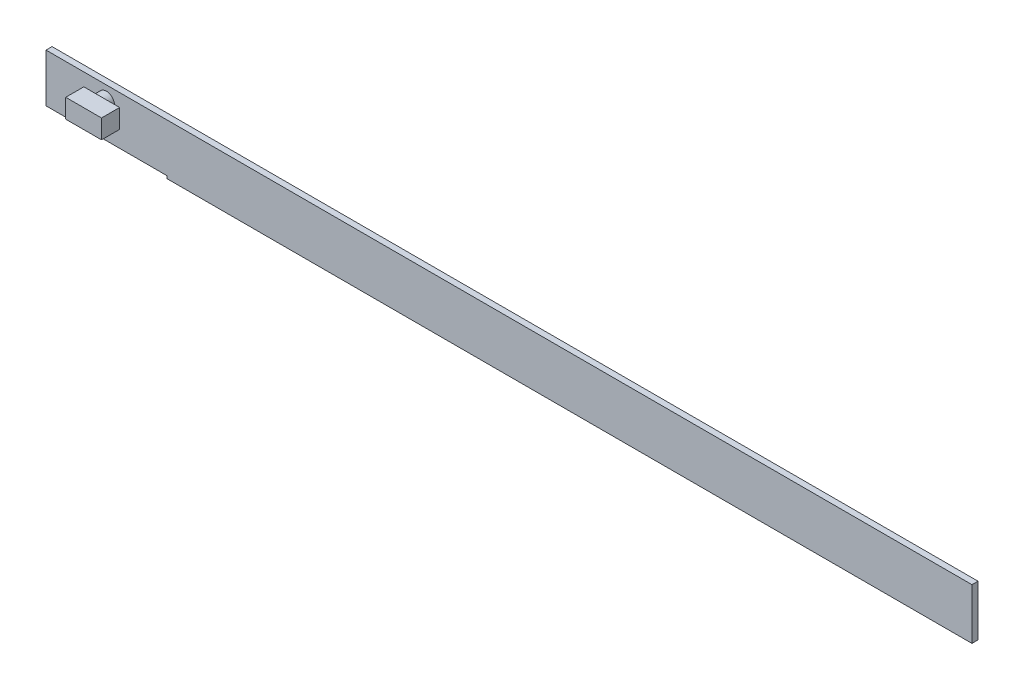
ISO-10303-21;
HEADER;
FILE_DESCRIPTION(('STEP AP214'),'2;1');
FILE_NAME('part.step','',(''),(''),'','','');
FILE_SCHEMA(('AUTOMOTIVE_DESIGN { 1 0 10303 214 1 1 1 1 }'));
ENDSEC;
DATA;
#1=APPLICATION_CONTEXT('core data for automotive mechanical design processes');
#2=APPLICATION_PROTOCOL_DEFINITION('international standard','automotive_design',2000,#1);
#3=PRODUCT_CONTEXT('',#1,'mechanical');
#4=PRODUCT('Part','Part','',(#3));
#5=PRODUCT_RELATED_PRODUCT_CATEGORY('part','',(#4));
#6=PRODUCT_DEFINITION_FORMATION('','',#4);
#7=PRODUCT_DEFINITION_CONTEXT('part definition',#1,'design');
#8=PRODUCT_DEFINITION('design','',#6,#7);
#9=PRODUCT_DEFINITION_SHAPE('','',#8);
#10=(LENGTH_UNIT() NAMED_UNIT(*) SI_UNIT(.MILLI.,.METRE.));
#11=(NAMED_UNIT(*) PLANE_ANGLE_UNIT() SI_UNIT($,.RADIAN.));
#12=(NAMED_UNIT(*) SI_UNIT($,.STERADIAN.) SOLID_ANGLE_UNIT());
#13=UNCERTAINTY_MEASURE_WITH_UNIT(LENGTH_MEASURE(1.E-05),#10,'distance_accuracy_value','');
#14=(GEOMETRIC_REPRESENTATION_CONTEXT(3) GLOBAL_UNCERTAINTY_ASSIGNED_CONTEXT((#13)) GLOBAL_UNIT_ASSIGNED_CONTEXT((#10,
#11,#12)) REPRESENTATION_CONTEXT('',''));
#15=CARTESIAN_POINT('',(0.,0.,0.));
#16=DIRECTION('',(0.,0.,1.));
#17=DIRECTION('',(1.,0.,0.));
#18=AXIS2_PLACEMENT_3D('',#15,#16,#17);
#19=CARTESIAN_POINT('',(-20.6491653478111,-40.1681019854514,-11.0411090105735));
#20=DIRECTION('',(0.,0.,-1.));
#21=DIRECTION('',(0.,1.,0.));
#22=AXIS2_PLACEMENT_3D('',#19,#20,#21);
#23=PLANE('',#22);
#24=DIRECTION('',(-1.,0.,0.));
#25=VECTOR('',#24,1.);
#26=CARTESIAN_POINT('',(-20.6491653478111,-39.7871019854514,-11.0411090105735));
#27=LINE('',#26,#25);
#28=CARTESIAN_POINT('',(-13.3466653478111,-39.7871019854514,-11.0411090105735));
#29=VERTEX_POINT('',#28);
#30=CARTESIAN_POINT('',(-20.6491653478111,-39.7871019854514,-11.0411090105735));
#31=VERTEX_POINT('',#30);
#32=EDGE_CURVE('E115',#29,#31,#27,.T.);
#33=ORIENTED_EDGE('',*,*,#32,.T.);
#34=DIRECTION('',(0.,1.,0.));
#35=VECTOR('',#34,1.);
#36=CARTESIAN_POINT('',(-20.6491653478111,-40.1681019854514,-11.0411090105735));
#37=LINE('',#36,#35);
#38=CARTESIAN_POINT('',(-20.6491653478111,-40.1681019854514,-11.0411090105735));
#39=VERTEX_POINT('',#38);
#40=EDGE_CURVE('E118',#39,#31,#37,.T.);
#41=ORIENTED_EDGE('',*,*,#40,.F.);
#42=DIRECTION('',(-1.,0.,0.));
#43=VECTOR('',#42,1.);
#44=CARTESIAN_POINT('',(-20.6491653478111,-40.1681019854514,-11.0411090105735));
#45=LINE('',#44,#43);
#46=CARTESIAN_POINT('',(-19.6966653478111,-40.1681019854514,-11.0411090105735));
#47=VERTEX_POINT('',#46);
#48=EDGE_CURVE('E56',#47,#39,#45,.T.);
#49=ORIENTED_EDGE('',*,*,#48,.F.);
#50=DIRECTION('',(0.,1.,0.));
#51=VECTOR('',#50,1.);
#52=CARTESIAN_POINT('',(-19.6966653478111,-40.1884219854514,-11.0411090105735));
#53=LINE('',#52,#51);
#54=CARTESIAN_POINT('',(-19.6966653478111,-40.1884219854514,-11.0411090105735));
#55=VERTEX_POINT('',#54);
#56=EDGE_CURVE('E277',#55,#47,#53,.T.);
#57=ORIENTED_EDGE('',*,*,#56,.F.);
#58=DIRECTION('',(1.,0.,0.));
#59=VECTOR('',#58,1.);
#60=CARTESIAN_POINT('',(-19.6966653478111,-40.1884219854514,-11.0411090105735));
#61=LINE('',#60,#59);
#62=CARTESIAN_POINT('',(-13.3466653478111,-40.1884219854514,-11.0411090105735));
#63=VERTEX_POINT('',#62);
#64=EDGE_CURVE('E297',#55,#63,#61,.T.);
#65=ORIENTED_EDGE('',*,*,#64,.T.);
#66=DIRECTION('',(0.,1.,0.));
#67=VECTOR('',#66,1.);
#68=CARTESIAN_POINT('',(-13.3466653478111,-40.1884219854514,-11.0411090105735));
#69=LINE('',#68,#67);
#70=EDGE_CURVE('E138',#63,#29,#69,.T.);
#71=ORIENTED_EDGE('',*,*,#70,.T.);
#72=EDGE_LOOP('',(#33,#41,#49,#57,#65,#71));
#73=FACE_BOUND('',#72,.T.);
#74=CARTESIAN_POINT('',(-20.1729153478111,-39.8939134749875,-11.0411090105735));
#75=DIRECTION('',(0.,0.,-1.));
#76=DIRECTION('',(0.,1.,0.));
#77=AXIS2_PLACEMENT_3D('',#74,#75,#76);
#78=CIRCLE('',#77,0.0642779678932168);
#79=CARTESIAN_POINT('',(-20.1729153478111,-39.8296355070943,-11.0411090105735));
#80=VERTEX_POINT('',#79);
#81=EDGE_CURVE('E11',#80,#80,#78,.F.);
#82=ORIENTED_EDGE('',*,*,#81,.F.);
#83=EDGE_LOOP('',(#82));
#84=FACE_BOUND('',#83,.T.);
#85=ADVANCED_FACE('F37',(#73,#84),#23,.F.);
#86=CARTESIAN_POINT('',(-20.6491653478111,-40.1681019854514,-11.0411090105735));
#87=DIRECTION('',(1.,0.,0.));
#88=DIRECTION('',(0.,1.,0.));
#89=AXIS2_PLACEMENT_3D('',#86,#87,#88);
#90=PLANE('',#89);
#91=DIRECTION('',(0.,0.,-1.));
#92=VECTOR('',#91,1.);
#93=CARTESIAN_POINT('',(-20.6491653478111,-39.7871019854514,-11.0411090105735));
#94=LINE('',#93,#92);
#95=CARTESIAN_POINT('',(-20.6491653478111,-39.7871019854514,-11.0887340105735));
#96=VERTEX_POINT('',#95);
#97=EDGE_CURVE('E117',#31,#96,#94,.T.);
#98=ORIENTED_EDGE('',*,*,#97,.T.);
#99=DIRECTION('',(0.,1.,0.));
#100=VECTOR('',#99,1.);
#101=CARTESIAN_POINT('',(-20.6491653478111,-40.1681019854514,-11.0887340105735));
#102=LINE('',#101,#100);
#103=CARTESIAN_POINT('',(-20.6491653478111,-40.1681019854514,-11.0887340105735));
#104=VERTEX_POINT('',#103);
#105=EDGE_CURVE('E47',#104,#96,#102,.T.);
#106=ORIENTED_EDGE('',*,*,#105,.F.);
#107=DIRECTION('',(0.,0.,-1.));
#108=VECTOR('',#107,1.);
#109=CARTESIAN_POINT('',(-20.6491653478111,-40.1681019854514,-11.0411090105735));
#110=LINE('',#109,#108);
#111=EDGE_CURVE('E110',#39,#104,#110,.T.);
#112=ORIENTED_EDGE('',*,*,#111,.F.);
#113=ORIENTED_EDGE('',*,*,#40,.T.);
#114=EDGE_LOOP('',(#98,#106,#112,#113));
#115=FACE_BOUND('',#114,.T.);
#116=ADVANCED_FACE('F39',(#115),#90,.F.);
#117=CARTESIAN_POINT('',(-20.6491653478111,-40.1681019854514,-11.0887340105735));
#118=DIRECTION('',(0.,0.,1.));
#119=DIRECTION('',(0.,-1.,0.));
#120=AXIS2_PLACEMENT_3D('',#117,#118,#119);
#121=PLANE('',#120);
#122=DIRECTION('',(1.,0.,0.));
#123=VECTOR('',#122,1.);
#124=CARTESIAN_POINT('',(-20.6491653478111,-39.7871019854514,-11.0887340105735));
#125=LINE('',#124,#123);
#126=CARTESIAN_POINT('',(-13.3466653478111,-39.7871019854514,-11.0887340105735));
#127=VERTEX_POINT('',#126);
#128=EDGE_CURVE('E69',#96,#127,#125,.T.);
#129=ORIENTED_EDGE('',*,*,#128,.T.);
#130=DIRECTION('',(0.,1.,0.));
#131=VECTOR('',#130,1.);
#132=CARTESIAN_POINT('',(-13.3466653478111,-40.1884219854514,-11.0887340105735));
#133=LINE('',#132,#131);
#134=CARTESIAN_POINT('',(-13.3466653478111,-40.1884219854514,-11.0887340105735));
#135=VERTEX_POINT('',#134);
#136=EDGE_CURVE('E246',#135,#127,#133,.T.);
#137=ORIENTED_EDGE('',*,*,#136,.F.);
#138=DIRECTION('',(-1.,0.,0.));
#139=VECTOR('',#138,1.);
#140=CARTESIAN_POINT('',(-19.6966653478111,-40.1884219854514,-11.0887340105735));
#141=LINE('',#140,#139);
#142=CARTESIAN_POINT('',(-19.6966653478111,-40.1884219854514,-11.0887340105735));
#143=VERTEX_POINT('',#142);
#144=EDGE_CURVE('E299',#135,#143,#141,.T.);
#145=ORIENTED_EDGE('',*,*,#144,.T.);
#146=DIRECTION('',(0.,1.,0.));
#147=VECTOR('',#146,1.);
#148=CARTESIAN_POINT('',(-19.6966653478111,-40.1884219854514,-11.0887340105735));
#149=LINE('',#148,#147);
#150=CARTESIAN_POINT('',(-19.6966653478111,-40.1681019854514,-11.0887340105735));
#151=VERTEX_POINT('',#150);
#152=EDGE_CURVE('E108',#143,#151,#149,.T.);
#153=ORIENTED_EDGE('',*,*,#152,.T.);
#154=DIRECTION('',(1.,0.,0.));
#155=VECTOR('',#154,1.);
#156=CARTESIAN_POINT('',(-20.6491653478111,-40.1681019854514,-11.0887340105735));
#157=LINE('',#156,#155);
#158=EDGE_CURVE('E102',#104,#151,#157,.T.);
#159=ORIENTED_EDGE('',*,*,#158,.F.);
#160=ORIENTED_EDGE('',*,*,#105,.T.);
#161=EDGE_LOOP('',(#129,#137,#145,#153,#159,#160));
#162=FACE_BOUND('',#161,.T.);
#163=ADVANCED_FACE('F103',(#162),#121,.F.);
#164=CARTESIAN_POINT('',(-20.4696557324265,-40.1681019854514,-11.120789299035));
#165=DIRECTION('',(0.,-1.,0.));
#166=DIRECTION('',(1.,0.,0.));
#167=AXIS2_PLACEMENT_3D('',#164,#165,#166);
#168=PLANE('',#167);
#169=ORIENTED_EDGE('',*,*,#111,.T.);
#170=ORIENTED_EDGE('',*,*,#158,.T.);
#171=DIRECTION('',(0.,0.,1.));
#172=VECTOR('',#171,1.);
#173=CARTESIAN_POINT('',(-19.6966653478111,-40.1681019854514,-11.0411090105735));
#174=LINE('',#173,#172);
#175=EDGE_CURVE('E109',#151,#47,#174,.T.);
#176=ORIENTED_EDGE('',*,*,#175,.T.);
#177=ORIENTED_EDGE('',*,*,#48,.T.);
#178=EDGE_LOOP('',(#169,#170,#176,#177));
#179=FACE_BOUND('',#178,.T.);
#180=ADVANCED_FACE('F112',(#179),#168,.T.);
#181=CARTESIAN_POINT('',(-20.4696557324265,-39.7871019854514,-11.120789299035));
#182=DIRECTION('',(0.,-1.,0.));
#183=DIRECTION('',(1.,0.,0.));
#184=AXIS2_PLACEMENT_3D('',#181,#182,#183);
#185=PLANE('',#184);
#186=ORIENTED_EDGE('',*,*,#97,.F.);
#187=ORIENTED_EDGE('',*,*,#32,.F.);
#188=DIRECTION('',(0.,0.,-1.));
#189=VECTOR('',#188,1.);
#190=CARTESIAN_POINT('',(-13.3466653478111,-39.7871019854514,-11.0887340105735));
#191=LINE('',#190,#189);
#192=EDGE_CURVE('E306',#29,#127,#191,.T.);
#193=ORIENTED_EDGE('',*,*,#192,.T.);
#194=ORIENTED_EDGE('',*,*,#128,.F.);
#195=EDGE_LOOP('',(#186,#187,#193,#194));
#196=FACE_BOUND('',#195,.T.);
#197=ADVANCED_FACE('F140',(#196),#185,.F.);
#198=CARTESIAN_POINT('',(-20.1729153478111,-39.8939134749875,-10.9696715105735));
#199=DIRECTION('',(0.,0.,-1.));
#200=DIRECTION('',(0.,1.,0.));
#201=AXIS2_PLACEMENT_3D('',#198,#199,#200);
#202=CYLINDRICAL_SURFACE('',#201,0.0642779678932168);
#203=CARTESIAN_POINT('',(-20.1729153478111,-39.8939134749875,-10.9696715105735));
#204=DIRECTION('',(0.,0.,1.));
#205=DIRECTION('',(0.,-1.,0.));
#206=AXIS2_PLACEMENT_3D('',#203,#204,#205);
#207=CIRCLE('',#206,0.0642779678932168);
#208=CARTESIAN_POINT('',(-20.1729153478111,-39.9581914428807,-10.9696715105735));
#209=VERTEX_POINT('',#208);
#210=EDGE_CURVE('E130',#209,#209,#207,.T.);
#211=ORIENTED_EDGE('',*,*,#210,.F.);
#212=EDGE_LOOP('',(#211));
#213=FACE_BOUND('',#212,.T.);
#214=ORIENTED_EDGE('',*,*,#81,.T.);
#215=EDGE_LOOP('',(#214));
#216=FACE_BOUND('',#215,.T.);
#217=ADVANCED_FACE('F142',(#213,#216),#202,.T.);
#218=CARTESIAN_POINT('',(-20.4696557324265,-39.7871019854514,-10.9696715105735));
#219=DIRECTION('',(0.,0.,1.));
#220=DIRECTION('',(0.,-1.,0.));
#221=AXIS2_PLACEMENT_3D('',#218,#219,#220);
#222=PLANE('',#221);
#223=DIRECTION('',(0.,-1.,0.));
#224=VECTOR('',#223,1.);
#225=CARTESIAN_POINT('',(-20.2792776210793,-39.817518183672,-10.9696715105735));
#226=LINE('',#225,#224);
#227=CARTESIAN_POINT('',(-20.2792776210793,-39.817518183672,-10.9696715105735));
#228=VERTEX_POINT('',#227);
#229=CARTESIAN_POINT('',(-20.2792776210793,-39.9673497644482,-10.9696715105735));
#230=VERTEX_POINT('',#229);
#231=EDGE_CURVE('E236',#228,#230,#226,.T.);
#232=ORIENTED_EDGE('',*,*,#231,.F.);
#233=DIRECTION('',(-1.,0.,0.));
#234=VECTOR('',#233,1.);
#235=CARTESIAN_POINT('',(-20.2792776210793,-39.817518183672,-10.9696715105735));
#236=LINE('',#235,#234);
#237=CARTESIAN_POINT('',(-19.9971428302474,-39.817518183672,-10.9696715105735));
#238=VERTEX_POINT('',#237);
#239=EDGE_CURVE('E252',#238,#228,#236,.T.);
#240=ORIENTED_EDGE('',*,*,#239,.F.);
#241=DIRECTION('',(0.,1.,0.));
#242=VECTOR('',#241,1.);
#243=CARTESIAN_POINT('',(-19.9971428302474,-39.817518183672,-10.9696715105735));
#244=LINE('',#243,#242);
#245=CARTESIAN_POINT('',(-19.9971428302474,-39.9673497644482,-10.9696715105735));
#246=VERTEX_POINT('',#245);
#247=EDGE_CURVE('E244',#246,#238,#244,.T.);
#248=ORIENTED_EDGE('',*,*,#247,.F.);
#249=DIRECTION('',(1.,0.,0.));
#250=VECTOR('',#249,1.);
#251=CARTESIAN_POINT('',(-20.2792776210793,-39.9673497644482,-10.9696715105735));
#252=LINE('',#251,#250);
#253=EDGE_CURVE('E242',#230,#246,#252,.T.);
#254=ORIENTED_EDGE('',*,*,#253,.F.);
#255=EDGE_LOOP('',(#232,#240,#248,#254));
#256=FACE_BOUND('',#255,.T.);
#257=ORIENTED_EDGE('',*,*,#210,.T.);
#258=EDGE_LOOP('',(#257));
#259=FACE_BOUND('',#258,.T.);
#260=ADVANCED_FACE('F148',(#256,#259),#222,.F.);
#261=CARTESIAN_POINT('',(-20.2792776210793,-39.817518183672,-10.8267965105735));
#262=DIRECTION('',(1.,0.,0.));
#263=DIRECTION('',(0.,1.,0.));
#264=AXIS2_PLACEMENT_3D('',#261,#262,#263);
#265=PLANE('',#264);
#266=ORIENTED_EDGE('',*,*,#231,.T.);
#267=DIRECTION('',(0.,0.,-1.));
#268=VECTOR('',#267,1.);
#269=CARTESIAN_POINT('',(-20.2792776210793,-39.9673497644482,-10.8267965105735));
#270=LINE('',#269,#268);
#271=CARTESIAN_POINT('',(-20.2792776210793,-39.9673497644482,-10.8267965105735));
#272=VERTEX_POINT('',#271);
#273=EDGE_CURVE('E239',#272,#230,#270,.T.);
#274=ORIENTED_EDGE('',*,*,#273,.F.);
#275=DIRECTION('',(0.,-1.,0.));
#276=VECTOR('',#275,1.);
#277=CARTESIAN_POINT('',(-20.2792776210793,-39.817518183672,-10.8267965105735));
#278=LINE('',#277,#276);
#279=CARTESIAN_POINT('',(-20.2792776210793,-39.817518183672,-10.8267965105735));
#280=VERTEX_POINT('',#279);
#281=EDGE_CURVE('E254',#280,#272,#278,.T.);
#282=ORIENTED_EDGE('',*,*,#281,.F.);
#283=DIRECTION('',(0.,0.,-1.));
#284=VECTOR('',#283,1.);
#285=CARTESIAN_POINT('',(-20.2792776210793,-39.817518183672,-10.8267965105735));
#286=LINE('',#285,#284);
#287=EDGE_CURVE('E240',#280,#228,#286,.T.);
#288=ORIENTED_EDGE('',*,*,#287,.T.);
#289=EDGE_LOOP('',(#266,#274,#282,#288));
#290=FACE_BOUND('',#289,.T.);
#291=ADVANCED_FACE('F215',(#290),#265,.F.);
#292=CARTESIAN_POINT('',(-20.2792776210793,-39.9673497644482,-10.8267965105735));
#293=DIRECTION('',(0.,1.,0.));
#294=DIRECTION('',(-1.,0.,0.));
#295=AXIS2_PLACEMENT_3D('',#292,#293,#294);
#296=PLANE('',#295);
#297=ORIENTED_EDGE('',*,*,#253,.T.);
#298=DIRECTION('',(0.,0.,-1.));
#299=VECTOR('',#298,1.);
#300=CARTESIAN_POINT('',(-19.9971428302474,-39.9673497644482,-10.8267965105735));
#301=LINE('',#300,#299);
#302=CARTESIAN_POINT('',(-19.9971428302474,-39.9673497644482,-10.8267965105735));
#303=VERTEX_POINT('',#302);
#304=EDGE_CURVE('E259',#303,#246,#301,.T.);
#305=ORIENTED_EDGE('',*,*,#304,.F.);
#306=DIRECTION('',(1.,0.,0.));
#307=VECTOR('',#306,1.);
#308=CARTESIAN_POINT('',(-20.2792776210793,-39.9673497644482,-10.8267965105735));
#309=LINE('',#308,#307);
#310=EDGE_CURVE('E270',#272,#303,#309,.T.);
#311=ORIENTED_EDGE('',*,*,#310,.F.);
#312=ORIENTED_EDGE('',*,*,#273,.T.);
#313=EDGE_LOOP('',(#297,#305,#311,#312));
#314=FACE_BOUND('',#313,.T.);
#315=ADVANCED_FACE('F223',(#314),#296,.F.);
#316=CARTESIAN_POINT('',(-19.9971428302474,-39.817518183672,-10.8267965105735));
#317=DIRECTION('',(-1.,0.,0.));
#318=DIRECTION('',(0.,-1.,0.));
#319=AXIS2_PLACEMENT_3D('',#316,#317,#318);
#320=PLANE('',#319);
#321=ORIENTED_EDGE('',*,*,#247,.T.);
#322=DIRECTION('',(0.,0.,-1.));
#323=VECTOR('',#322,1.);
#324=CARTESIAN_POINT('',(-19.9971428302474,-39.817518183672,-10.8267965105735));
#325=LINE('',#324,#323);
#326=CARTESIAN_POINT('',(-19.9971428302474,-39.817518183672,-10.8267965105735));
#327=VERTEX_POINT('',#326);
#328=EDGE_CURVE('E256',#327,#238,#325,.T.);
#329=ORIENTED_EDGE('',*,*,#328,.F.);
#330=DIRECTION('',(0.,1.,0.));
#331=VECTOR('',#330,1.);
#332=CARTESIAN_POINT('',(-19.9971428302474,-39.817518183672,-10.8267965105735));
#333=LINE('',#332,#331);
#334=EDGE_CURVE('E273',#303,#327,#333,.T.);
#335=ORIENTED_EDGE('',*,*,#334,.F.);
#336=ORIENTED_EDGE('',*,*,#304,.T.);
#337=EDGE_LOOP('',(#321,#329,#335,#336));
#338=FACE_BOUND('',#337,.T.);
#339=ADVANCED_FACE('F219',(#338),#320,.F.);
#340=CARTESIAN_POINT('',(-20.2792776210793,-39.817518183672,-10.8267965105735));
#341=DIRECTION('',(0.,-1.,0.));
#342=DIRECTION('',(1.,0.,0.));
#343=AXIS2_PLACEMENT_3D('',#340,#341,#342);
#344=PLANE('',#343);
#345=ORIENTED_EDGE('',*,*,#239,.T.);
#346=ORIENTED_EDGE('',*,*,#287,.F.);
#347=DIRECTION('',(-1.,0.,0.));
#348=VECTOR('',#347,1.);
#349=CARTESIAN_POINT('',(-20.2792776210793,-39.817518183672,-10.8267965105735));
#350=LINE('',#349,#348);
#351=EDGE_CURVE('E79',#327,#280,#350,.T.);
#352=ORIENTED_EDGE('',*,*,#351,.F.);
#353=ORIENTED_EDGE('',*,*,#328,.T.);
#354=EDGE_LOOP('',(#345,#346,#352,#353));
#355=FACE_BOUND('',#354,.T.);
#356=ADVANCED_FACE('F212',(#355),#344,.F.);
#357=CARTESIAN_POINT('',(-20.4696557324265,-39.7871019854514,-10.8267965105735));
#358=DIRECTION('',(0.,0.,1.));
#359=DIRECTION('',(0.,-1.,0.));
#360=AXIS2_PLACEMENT_3D('',#357,#358,#359);
#361=PLANE('',#360);
#362=ORIENTED_EDGE('',*,*,#281,.T.);
#363=ORIENTED_EDGE('',*,*,#310,.T.);
#364=ORIENTED_EDGE('',*,*,#334,.T.);
#365=ORIENTED_EDGE('',*,*,#351,.T.);
#366=EDGE_LOOP('',(#362,#363,#364,#365));
#367=FACE_BOUND('',#366,.T.);
#368=ADVANCED_FACE('F184',(#367),#361,.T.);
#369=CARTESIAN_POINT('',(-19.6966653478111,-40.1884219854514,-11.0887340105735));
#370=DIRECTION('',(-1.,0.,0.));
#371=DIRECTION('',(0.,0.,1.));
#372=AXIS2_PLACEMENT_3D('',#369,#370,#371);
#373=PLANE('',#372);
#374=ORIENTED_EDGE('',*,*,#175,.F.);
#375=ORIENTED_EDGE('',*,*,#152,.F.);
#376=DIRECTION('',(0.,0.,1.));
#377=VECTOR('',#376,1.);
#378=CARTESIAN_POINT('',(-19.6966653478111,-40.1884219854514,-11.0887340105735));
#379=LINE('',#378,#377);
#380=EDGE_CURVE('E302',#143,#55,#379,.T.);
#381=ORIENTED_EDGE('',*,*,#380,.T.);
#382=ORIENTED_EDGE('',*,*,#56,.T.);
#383=EDGE_LOOP('',(#374,#375,#381,#382));
#384=FACE_BOUND('',#383,.T.);
#385=ADVANCED_FACE('F179',(#384),#373,.T.);
#386=CARTESIAN_POINT('',(-13.3466653478111,-40.1884219854514,-11.0887340105735));
#387=DIRECTION('',(1.,0.,0.));
#388=DIRECTION('',(0.,0.,-1.));
#389=AXIS2_PLACEMENT_3D('',#386,#387,#388);
#390=PLANE('',#389);
#391=ORIENTED_EDGE('',*,*,#192,.F.);
#392=ORIENTED_EDGE('',*,*,#70,.F.);
#393=DIRECTION('',(0.,0.,-1.));
#394=VECTOR('',#393,1.);
#395=CARTESIAN_POINT('',(-13.3466653478111,-40.1884219854514,-11.0887340105735));
#396=LINE('',#395,#394);
#397=EDGE_CURVE('E304',#63,#135,#396,.T.);
#398=ORIENTED_EDGE('',*,*,#397,.T.);
#399=ORIENTED_EDGE('',*,*,#136,.T.);
#400=EDGE_LOOP('',(#391,#392,#398,#399));
#401=FACE_BOUND('',#400,.T.);
#402=ADVANCED_FACE('F183',(#401),#390,.T.);
#403=CARTESIAN_POINT('',(0.,-40.1884219854514,0.));
#404=DIRECTION('',(0.,1.,0.));
#405=DIRECTION('',(0.,0.,1.));
#406=AXIS2_PLACEMENT_3D('',#403,#404,#405);
#407=PLANE('',#406);
#408=ORIENTED_EDGE('',*,*,#380,.F.);
#409=ORIENTED_EDGE('',*,*,#144,.F.);
#410=ORIENTED_EDGE('',*,*,#397,.F.);
#411=ORIENTED_EDGE('',*,*,#64,.F.);
#412=EDGE_LOOP('',(#408,#409,#410,#411));
#413=FACE_BOUND('',#412,.T.);
#414=ADVANCED_FACE('F195',(#413),#407,.F.);
#415=CLOSED_SHELL('',(#85,#116,#163,#180,#197,#217,#260,#291,#315,#339,#356,#368,#385,#402,#414));
#416=MANIFOLD_SOLID_BREP('B2',#415);
#417=ADVANCED_BREP_SHAPE_REPRESENTATION('',(#18,#416),#14);
#418=SHAPE_DEFINITION_REPRESENTATION(#9,#417);
ENDSEC;
END-ISO-10303-21;
